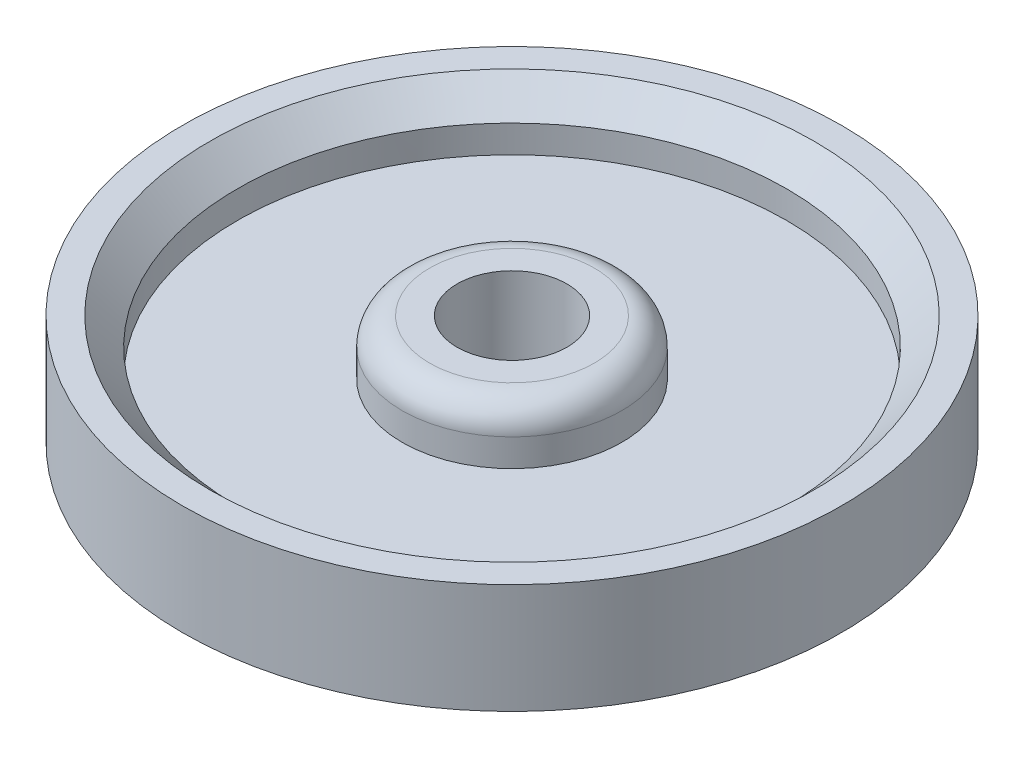
ISO-10303-21;
HEADER;
FILE_DESCRIPTION(('STEP AP214'),'2;1');
FILE_NAME('part.step','',(''),(''),'','','');
FILE_SCHEMA(('AUTOMOTIVE_DESIGN { 1 0 10303 214 1 1 1 1 }'));
ENDSEC;
DATA;
#1=APPLICATION_CONTEXT('core data for automotive mechanical design processes');
#2=APPLICATION_PROTOCOL_DEFINITION('international standard','automotive_design',2000,#1);
#3=PRODUCT_CONTEXT('',#1,'mechanical');
#4=PRODUCT('Part','Part','',(#3));
#5=PRODUCT_RELATED_PRODUCT_CATEGORY('part','',(#4));
#6=PRODUCT_DEFINITION_FORMATION('','',#4);
#7=PRODUCT_DEFINITION_CONTEXT('part definition',#1,'design');
#8=PRODUCT_DEFINITION('design','',#6,#7);
#9=PRODUCT_DEFINITION_SHAPE('','',#8);
#10=(LENGTH_UNIT() NAMED_UNIT(*) SI_UNIT(.MILLI.,.METRE.));
#11=(NAMED_UNIT(*) PLANE_ANGLE_UNIT() SI_UNIT($,.RADIAN.));
#12=(NAMED_UNIT(*) SI_UNIT($,.STERADIAN.) SOLID_ANGLE_UNIT());
#13=UNCERTAINTY_MEASURE_WITH_UNIT(LENGTH_MEASURE(1.E-05),#10,'distance_accuracy_value','');
#14=(GEOMETRIC_REPRESENTATION_CONTEXT(3) GLOBAL_UNCERTAINTY_ASSIGNED_CONTEXT((#13)) GLOBAL_UNIT_ASSIGNED_CONTEXT((#10,
#11,#12)) REPRESENTATION_CONTEXT('',''));
#15=CARTESIAN_POINT('',(0.,0.,0.));
#16=DIRECTION('',(0.,0.,1.));
#17=DIRECTION('',(1.,0.,0.));
#18=AXIS2_PLACEMENT_3D('',#15,#16,#17);
#19=CARTESIAN_POINT('',(24.3015329022552,20.,-9.85197279821157));
#20=DIRECTION('',(0.,-1.,0.));
#21=DIRECTION('',(0.,0.,-1.));
#22=AXIS2_PLACEMENT_3D('',#19,#20,#21);
#23=CYLINDRICAL_SURFACE('',#22,20.);
#24=CARTESIAN_POINT('',(24.3015329022552,15.,-9.85197279821157));
#25=DIRECTION('',(0.,1.,0.));
#26=DIRECTION('',(0.,0.,1.));
#27=AXIS2_PLACEMENT_3D('',#24,#25,#26);
#28=CIRCLE('',#27,20.);
#29=CARTESIAN_POINT('',(24.3015329022552,15.,10.1480272017884));
#30=VERTEX_POINT('',#29);
#31=EDGE_CURVE('E11',#30,#30,#28,.F.);
#32=ORIENTED_EDGE('',*,*,#31,.T.);
#33=EDGE_LOOP('',(#32));
#34=FACE_BOUND('',#33,.T.);
#35=CARTESIAN_POINT('',(24.3015329022552,10.,-9.85197279821157));
#36=DIRECTION('',(0.,-1.,0.));
#37=DIRECTION('',(0.,0.,-1.));
#38=AXIS2_PLACEMENT_3D('',#35,#36,#37);
#39=CIRCLE('',#38,20.);
#40=CARTESIAN_POINT('',(24.3015329022552,10.,-29.8519727982116));
#41=VERTEX_POINT('',#40);
#42=EDGE_CURVE('E59',#41,#41,#39,.T.);
#43=ORIENTED_EDGE('',*,*,#42,.F.);
#44=EDGE_LOOP('',(#43));
#45=FACE_BOUND('',#44,.T.);
#46=ADVANCED_FACE('F39',(#34,#45),#23,.T.);
#47=CARTESIAN_POINT('',(-107.839888453982,20.,-9.85197279821156));
#48=DIRECTION('',(0.,1.,0.));
#49=DIRECTION('',(0.,0.,1.));
#50=AXIS2_PLACEMENT_3D('',#47,#48,#49);
#51=PLANE('',#50);
#52=CARTESIAN_POINT('',(24.3015329022552,20.,-9.85197279821157));
#53=DIRECTION('',(0.,1.,0.));
#54=DIRECTION('',(0.,0.,1.));
#55=AXIS2_PLACEMENT_3D('',#52,#53,#54);
#56=CIRCLE('',#55,10.);
#57=CARTESIAN_POINT('',(24.3015329022552,20.,0.148027201788435));
#58=VERTEX_POINT('',#57);
#59=EDGE_CURVE('E71',#58,#58,#56,.T.);
#60=ORIENTED_EDGE('',*,*,#59,.F.);
#61=EDGE_LOOP('',(#60));
#62=FACE_BOUND('',#61,.T.);
#63=CARTESIAN_POINT('',(24.3015329022552,20.,-9.85197279821157));
#64=DIRECTION('',(0.,1.,0.));
#65=DIRECTION('',(0.,0.,1.));
#66=AXIS2_PLACEMENT_3D('',#63,#64,#65);
#67=CIRCLE('',#66,15.);
#68=CARTESIAN_POINT('',(24.3015329022552,20.,5.14802720178844));
#69=VERTEX_POINT('',#68);
#70=EDGE_CURVE('E47',#69,#69,#67,.T.);
#71=ORIENTED_EDGE('',*,*,#70,.T.);
#72=EDGE_LOOP('',(#71));
#73=FACE_BOUND('',#72,.T.);
#74=ADVANCED_FACE('F91',(#62,#73),#51,.T.);
#75=CARTESIAN_POINT('',(24.3015329022552,10.,-9.85197279821157));
#76=DIRECTION('',(0.,-1.,0.));
#77=DIRECTION('',(0.,0.,-1.));
#78=AXIS2_PLACEMENT_3D('',#75,#76,#77);
#79=PLANE('',#78);
#80=ORIENTED_EDGE('',*,*,#42,.T.);
#81=EDGE_LOOP('',(#80));
#82=FACE_BOUND('',#81,.T.);
#83=CARTESIAN_POINT('',(24.3015329022552,10.,-9.85197279821157));
#84=DIRECTION('',(0.,-1.,0.));
#85=DIRECTION('',(0.,0.,-1.));
#86=AXIS2_PLACEMENT_3D('',#83,#84,#85);
#87=CIRCLE('',#86,50.);
#88=CARTESIAN_POINT('',(24.3015329022552,10.,-59.8519727982116));
#89=VERTEX_POINT('',#88);
#90=EDGE_CURVE('E62',#89,#89,#87,.T.);
#91=ORIENTED_EDGE('',*,*,#90,.F.);
#92=EDGE_LOOP('',(#91));
#93=FACE_BOUND('',#92,.T.);
#94=ADVANCED_FACE('F96',(#82,#93),#79,.F.);
#95=CARTESIAN_POINT('',(24.3015329022552,20.,-9.85197279821157));
#96=DIRECTION('',(0.,-1.,0.));
#97=DIRECTION('',(0.,0.,-1.));
#98=AXIS2_PLACEMENT_3D('',#95,#96,#97);
#99=CYLINDRICAL_SURFACE('',#98,50.);
#100=CARTESIAN_POINT('',(24.3015329022552,15.0000000000001,-9.85197279821157));
#101=DIRECTION('',(0.,1.,0.));
#102=DIRECTION('',(0.,0.,1.));
#103=AXIS2_PLACEMENT_3D('',#100,#101,#102);
#104=CIRCLE('',#103,50.);
#105=CARTESIAN_POINT('',(24.3015329022552,15.0000000000001,40.1480272017885));
#106=VERTEX_POINT('',#105);
#107=EDGE_CURVE('E56',#106,#106,#104,.T.);
#108=ORIENTED_EDGE('',*,*,#107,.T.);
#109=EDGE_LOOP('',(#108));
#110=FACE_BOUND('',#109,.T.);
#111=ORIENTED_EDGE('',*,*,#90,.T.);
#112=EDGE_LOOP('',(#111));
#113=FACE_BOUND('',#112,.T.);
#114=ADVANCED_FACE('F111',(#110,#113),#99,.F.);
#115=CARTESIAN_POINT('',(24.3015329022552,20.,-9.85197279821157));
#116=DIRECTION('',(0.,-1.,0.));
#117=DIRECTION('',(0.,0.,-1.));
#118=AXIS2_PLACEMENT_3D('',#115,#116,#117);
#119=CYLINDRICAL_SURFACE('',#118,60.);
#120=CARTESIAN_POINT('',(24.3015329022552,20.,-9.85197279821157));
#121=DIRECTION('',(0.,1.,0.));
#122=DIRECTION('',(0.,0.,1.));
#123=AXIS2_PLACEMENT_3D('',#120,#121,#122);
#124=CIRCLE('',#123,60.);
#125=CARTESIAN_POINT('',(24.3015329022552,20.,50.1480272017884));
#126=VERTEX_POINT('',#125);
#127=EDGE_CURVE('E65',#126,#126,#124,.T.);
#128=ORIENTED_EDGE('',*,*,#127,.F.);
#129=EDGE_LOOP('',(#128));
#130=FACE_BOUND('',#129,.T.);
#131=CARTESIAN_POINT('',(24.3015329022552,0.,-9.85197279821157));
#132=DIRECTION('',(0.,1.,0.));
#133=DIRECTION('',(0.,0.,1.));
#134=AXIS2_PLACEMENT_3D('',#131,#132,#133);
#135=CIRCLE('',#134,60.);
#136=CARTESIAN_POINT('',(24.3015329022552,0.,50.1480272017884));
#137=VERTEX_POINT('',#136);
#138=EDGE_CURVE('E66',#137,#137,#135,.T.);
#139=ORIENTED_EDGE('',*,*,#138,.T.);
#140=EDGE_LOOP('',(#139));
#141=FACE_BOUND('',#140,.T.);
#142=ADVANCED_FACE('F114',(#130,#141),#119,.T.);
#143=CARTESIAN_POINT('',(-107.839888453982,20.,-9.85197279821156));
#144=DIRECTION('',(0.,1.,0.));
#145=DIRECTION('',(0.,0.,1.));
#146=AXIS2_PLACEMENT_3D('',#143,#144,#145);
#147=PLANE('',#146);
#148=CARTESIAN_POINT('',(24.3015329022552,20.,-9.85197279821157));
#149=DIRECTION('',(0.,1.,0.));
#150=DIRECTION('',(0.,0.,1.));
#151=AXIS2_PLACEMENT_3D('',#148,#149,#150);
#152=CIRCLE('',#151,55.);
#153=CARTESIAN_POINT('',(24.3015329022552,20.,45.1480272017884));
#154=VERTEX_POINT('',#153);
#155=EDGE_CURVE('E51',#154,#154,#152,.F.);
#156=ORIENTED_EDGE('',*,*,#155,.T.);
#157=EDGE_LOOP('',(#156));
#158=FACE_BOUND('',#157,.T.);
#159=ORIENTED_EDGE('',*,*,#127,.T.);
#160=EDGE_LOOP('',(#159));
#161=FACE_BOUND('',#160,.T.);
#162=ADVANCED_FACE('F106',(#158,#161),#147,.T.);
#163=CARTESIAN_POINT('',(-107.839888453982,0.,-9.85197279821156));
#164=DIRECTION('',(0.,1.,0.));
#165=DIRECTION('',(0.,0.,1.));
#166=AXIS2_PLACEMENT_3D('',#163,#164,#165);
#167=PLANE('',#166);
#168=CARTESIAN_POINT('',(24.3015329022552,0.,-9.85197279821157));
#169=DIRECTION('',(0.,1.,0.));
#170=DIRECTION('',(0.,0.,1.));
#171=AXIS2_PLACEMENT_3D('',#168,#169,#170);
#172=CIRCLE('',#171,10.);
#173=CARTESIAN_POINT('',(24.3015329022552,0.,0.148027201788435));
#174=VERTEX_POINT('',#173);
#175=EDGE_CURVE('E43',#174,#174,#172,.T.);
#176=ORIENTED_EDGE('',*,*,#175,.T.);
#177=EDGE_LOOP('',(#176));
#178=FACE_BOUND('',#177,.T.);
#179=ORIENTED_EDGE('',*,*,#138,.F.);
#180=EDGE_LOOP('',(#179));
#181=FACE_BOUND('',#180,.T.);
#182=ADVANCED_FACE('F78',(#178,#181),#167,.F.);
#183=CARTESIAN_POINT('',(24.3015329022552,15.0000000000001,-9.85197279821157));
#184=DIRECTION('',(0.,1.,0.));
#185=DIRECTION('',(0.,0.,1.));
#186=AXIS2_PLACEMENT_3D('',#183,#184,#185);
#187=CONICAL_SURFACE('',#186,50.,0.785398163397451);
#188=ORIENTED_EDGE('',*,*,#155,.F.);
#189=EDGE_LOOP('',(#188));
#190=FACE_BOUND('',#189,.T.);
#191=ORIENTED_EDGE('',*,*,#107,.F.);
#192=EDGE_LOOP('',(#191));
#193=FACE_BOUND('',#192,.T.);
#194=ADVANCED_FACE('F87',(#190,#193),#187,.F.);
#195=CARTESIAN_POINT('',(24.3015329022552,15.,-9.85197279821157));
#196=DIRECTION('',(0.,1.,0.));
#197=DIRECTION('',(0.,0.,1.));
#198=AXIS2_PLACEMENT_3D('',#195,#196,#197);
#199=TOROIDAL_SURFACE('',#198,15.,5.);
#200=ORIENTED_EDGE('',*,*,#31,.F.);
#201=EDGE_LOOP('',(#200));
#202=FACE_BOUND('',#201,.T.);
#203=ORIENTED_EDGE('',*,*,#70,.F.);
#204=EDGE_LOOP('',(#203));
#205=FACE_BOUND('',#204,.T.);
#206=ADVANCED_FACE('F41',(#202,#205),#199,.T.);
#207=CARTESIAN_POINT('',(24.3015329022552,-62.,-9.85197279821157));
#208=DIRECTION('',(0.,1.,0.));
#209=DIRECTION('',(0.,0.,1.));
#210=AXIS2_PLACEMENT_3D('',#207,#208,#209);
#211=CYLINDRICAL_SURFACE('',#210,10.);
#212=ORIENTED_EDGE('',*,*,#59,.T.);
#213=EDGE_LOOP('',(#212));
#214=FACE_BOUND('',#213,.T.);
#215=ORIENTED_EDGE('',*,*,#175,.F.);
#216=EDGE_LOOP('',(#215));
#217=FACE_BOUND('',#216,.T.);
#218=ADVANCED_FACE('F81',(#214,#217),#211,.F.);
#219=CLOSED_SHELL('',(#46,#74,#94,#114,#142,#162,#182,#194,#206,#218));
#220=MANIFOLD_SOLID_BREP('B2',#219);
#221=ADVANCED_BREP_SHAPE_REPRESENTATION('',(#18,#220),#14);
#222=SHAPE_DEFINITION_REPRESENTATION(#9,#221);
ENDSEC;
END-ISO-10303-21;
